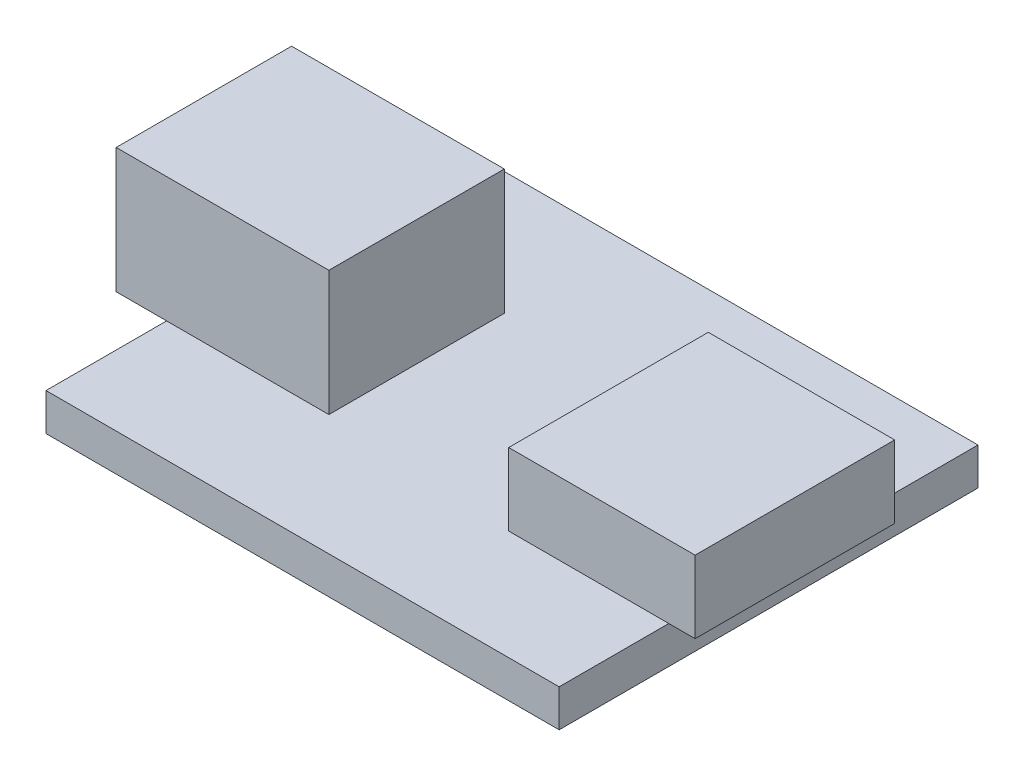
ISO-10303-21;
HEADER;
FILE_DESCRIPTION(('STEP AP214'),'2;1');
FILE_NAME('part.step','',(''),(''),'','','');
FILE_SCHEMA(('AUTOMOTIVE_DESIGN { 1 0 10303 214 1 1 1 1 }'));
ENDSEC;
DATA;
#1=APPLICATION_CONTEXT('core data for automotive mechanical design processes');
#2=APPLICATION_PROTOCOL_DEFINITION('international standard','automotive_design',2000,#1);
#3=PRODUCT_CONTEXT('',#1,'mechanical');
#4=PRODUCT('Part','Part','',(#3));
#5=PRODUCT_RELATED_PRODUCT_CATEGORY('part','',(#4));
#6=PRODUCT_DEFINITION_FORMATION('','',#4);
#7=PRODUCT_DEFINITION_CONTEXT('part definition',#1,'design');
#8=PRODUCT_DEFINITION('design','',#6,#7);
#9=PRODUCT_DEFINITION_SHAPE('','',#8);
#10=(LENGTH_UNIT() NAMED_UNIT(*) SI_UNIT(.MILLI.,.METRE.));
#11=(NAMED_UNIT(*) PLANE_ANGLE_UNIT() SI_UNIT($,.RADIAN.));
#12=(NAMED_UNIT(*) SI_UNIT($,.STERADIAN.) SOLID_ANGLE_UNIT());
#13=UNCERTAINTY_MEASURE_WITH_UNIT(LENGTH_MEASURE(1.E-05),#10,'distance_accuracy_value','');
#14=(GEOMETRIC_REPRESENTATION_CONTEXT(3) GLOBAL_UNCERTAINTY_ASSIGNED_CONTEXT((#13)) GLOBAL_UNIT_ASSIGNED_CONTEXT((#10,
#11,#12)) REPRESENTATION_CONTEXT('',''));
#15=CARTESIAN_POINT('',(0.,0.,0.));
#16=DIRECTION('',(0.,0.,1.));
#17=DIRECTION('',(1.,0.,0.));
#18=AXIS2_PLACEMENT_3D('',#15,#16,#17);
#19=CARTESIAN_POINT('',(-11.7,1.7,-9.55));
#20=DIRECTION('',(1.,0.,0.));
#21=DIRECTION('',(0.,0.,-1.));
#22=AXIS2_PLACEMENT_3D('',#19,#20,#21);
#23=PLANE('',#22);
#24=DIRECTION('',(0.,0.,1.));
#25=VECTOR('',#24,1.);
#26=CARTESIAN_POINT('',(-11.7,1.7,-3.95));
#27=LINE('',#26,#25);
#28=CARTESIAN_POINT('',(-11.7,1.7,-3.95));
#29=VERTEX_POINT('',#28);
#30=CARTESIAN_POINT('',(-11.7,1.7,4.05));
#31=VERTEX_POINT('',#30);
#32=EDGE_CURVE('E165',#29,#31,#27,.T.);
#33=ORIENTED_EDGE('',*,*,#32,.F.);
#34=DIRECTION('',(0.,0.,1.));
#35=VECTOR('',#34,1.);
#36=CARTESIAN_POINT('',(-11.7,1.7,-9.55));
#37=LINE('',#36,#35);
#38=CARTESIAN_POINT('',(-11.7,1.7,-9.55));
#39=VERTEX_POINT('',#38);
#40=EDGE_CURVE('E264',#39,#29,#37,.T.);
#41=ORIENTED_EDGE('',*,*,#40,.F.);
#42=DIRECTION('',(0.,-1.,0.));
#43=VECTOR('',#42,1.);
#44=CARTESIAN_POINT('',(-11.7,1.7,-9.55));
#45=LINE('',#44,#43);
#46=CARTESIAN_POINT('',(-11.7,0.,-9.55));
#47=VERTEX_POINT('',#46);
#48=EDGE_CURVE('E48',#39,#47,#45,.T.);
#49=ORIENTED_EDGE('',*,*,#48,.T.);
#50=DIRECTION('',(0.,0.,1.));
#51=VECTOR('',#50,1.);
#52=CARTESIAN_POINT('',(-11.7,0.,-9.55));
#53=LINE('',#52,#51);
#54=CARTESIAN_POINT('',(-11.7,0.,9.55));
#55=VERTEX_POINT('',#54);
#56=EDGE_CURVE('E277',#47,#55,#53,.T.);
#57=ORIENTED_EDGE('',*,*,#56,.T.);
#58=DIRECTION('',(0.,-1.,0.));
#59=VECTOR('',#58,1.);
#60=CARTESIAN_POINT('',(-11.7,1.7,9.55));
#61=LINE('',#60,#59);
#62=CARTESIAN_POINT('',(-11.7,1.7,9.55));
#63=VERTEX_POINT('',#62);
#64=EDGE_CURVE('E286',#63,#55,#61,.T.);
#65=ORIENTED_EDGE('',*,*,#64,.F.);
#66=EDGE_CURVE('E263',#31,#63,#37,.T.);
#67=ORIENTED_EDGE('',*,*,#66,.F.);
#68=EDGE_LOOP('',(#33,#41,#49,#57,#65,#67));
#69=FACE_BOUND('',#68,.T.);
#70=ADVANCED_FACE('F39',(#69),#23,.F.);
#71=CARTESIAN_POINT('',(0.,1.7,0.));
#72=DIRECTION('',(0.,1.,0.));
#73=DIRECTION('',(0.,0.,1.));
#74=AXIS2_PLACEMENT_3D('',#71,#72,#73);
#75=PLANE('',#74);
#76=DIRECTION('',(0.,0.,-1.));
#77=VECTOR('',#76,1.);
#78=CARTESIAN_POINT('',(-4.29999999999999,1.7,-3.95));
#79=LINE('',#78,#77);
#80=CARTESIAN_POINT('',(-4.29999999999999,1.7,4.05));
#81=VERTEX_POINT('',#80);
#82=CARTESIAN_POINT('',(-4.29999999999999,1.7,-3.95));
#83=VERTEX_POINT('',#82);
#84=EDGE_CURVE('E176',#81,#83,#79,.T.);
#85=ORIENTED_EDGE('',*,*,#84,.F.);
#86=DIRECTION('',(1.,0.,0.));
#87=VECTOR('',#86,1.);
#88=CARTESIAN_POINT('',(-11.7,1.7,4.05));
#89=LINE('',#88,#87);
#90=EDGE_CURVE('E172',#31,#81,#89,.T.);
#91=ORIENTED_EDGE('',*,*,#90,.F.);
#92=ORIENTED_EDGE('',*,*,#66,.T.);
#93=DIRECTION('',(1.,0.,0.));
#94=VECTOR('',#93,1.);
#95=CARTESIAN_POINT('',(-11.7,1.7,9.55));
#96=LINE('',#95,#94);
#97=CARTESIAN_POINT('',(11.7,1.7,9.55));
#98=VERTEX_POINT('',#97);
#99=EDGE_CURVE('E267',#63,#98,#96,.T.);
#100=ORIENTED_EDGE('',*,*,#99,.T.);
#101=DIRECTION('',(0.,0.,-1.));
#102=VECTOR('',#101,1.);
#103=CARTESIAN_POINT('',(11.7,1.7,-9.55));
#104=LINE('',#103,#102);
#105=CARTESIAN_POINT('',(11.7,1.7,4.55));
#106=VERTEX_POINT('',#105);
#107=EDGE_CURVE('E255',#98,#106,#104,.T.);
#108=ORIENTED_EDGE('',*,*,#107,.T.);
#109=DIRECTION('',(1.,0.,0.));
#110=VECTOR('',#109,1.);
#111=CARTESIAN_POINT('',(4.40000000000001,1.7,4.55));
#112=LINE('',#111,#110);
#113=CARTESIAN_POINT('',(4.40000000000001,1.7,4.55));
#114=VERTEX_POINT('',#113);
#115=EDGE_CURVE('E241',#114,#106,#112,.T.);
#116=ORIENTED_EDGE('',*,*,#115,.F.);
#117=DIRECTION('',(0.,0.,1.));
#118=VECTOR('',#117,1.);
#119=CARTESIAN_POINT('',(4.40000000000001,1.7,-4.55));
#120=LINE('',#119,#118);
#121=CARTESIAN_POINT('',(4.40000000000001,1.7,-4.55));
#122=VERTEX_POINT('',#121);
#123=EDGE_CURVE('E63',#122,#114,#120,.T.);
#124=ORIENTED_EDGE('',*,*,#123,.F.);
#125=DIRECTION('',(-1.,0.,0.));
#126=VECTOR('',#125,1.);
#127=CARTESIAN_POINT('',(4.40000000000001,1.7,-4.55));
#128=LINE('',#127,#126);
#129=CARTESIAN_POINT('',(11.7,1.7,-4.55));
#130=VERTEX_POINT('',#129);
#131=EDGE_CURVE('E232',#130,#122,#128,.T.);
#132=ORIENTED_EDGE('',*,*,#131,.F.);
#133=CARTESIAN_POINT('',(11.7,1.7,-9.55));
#134=VERTEX_POINT('',#133);
#135=EDGE_CURVE('E260',#130,#134,#104,.T.);
#136=ORIENTED_EDGE('',*,*,#135,.T.);
#137=DIRECTION('',(-1.,0.,0.));
#138=VECTOR('',#137,1.);
#139=CARTESIAN_POINT('',(-11.7,1.7,-9.55));
#140=LINE('',#139,#138);
#141=EDGE_CURVE('E259',#134,#39,#140,.T.);
#142=ORIENTED_EDGE('',*,*,#141,.T.);
#143=ORIENTED_EDGE('',*,*,#40,.T.);
#144=DIRECTION('',(-1.,0.,0.));
#145=VECTOR('',#144,1.);
#146=CARTESIAN_POINT('',(-11.7,1.7,-3.95));
#147=LINE('',#146,#145);
#148=EDGE_CURVE('E169',#83,#29,#147,.T.);
#149=ORIENTED_EDGE('',*,*,#148,.F.);
#150=EDGE_LOOP('',(#85,#91,#92,#100,#108,#116,#124,#132,#136,#142,#143,#149));
#151=FACE_BOUND('',#150,.T.);
#152=ADVANCED_FACE('F310',(#151),#75,.T.);
#153=CARTESIAN_POINT('',(11.7,1.7,-9.55));
#154=DIRECTION('',(-1.,0.,0.));
#155=DIRECTION('',(0.,0.,1.));
#156=AXIS2_PLACEMENT_3D('',#153,#154,#155);
#157=PLANE('',#156);
#158=DIRECTION('',(0.,0.,-1.));
#159=VECTOR('',#158,1.);
#160=CARTESIAN_POINT('',(11.7,1.7,4.55));
#161=LINE('',#160,#159);
#162=EDGE_CURVE('E200',#106,#130,#161,.T.);
#163=ORIENTED_EDGE('',*,*,#162,.F.);
#164=ORIENTED_EDGE('',*,*,#107,.F.);
#165=DIRECTION('',(0.,-1.,0.));
#166=VECTOR('',#165,1.);
#167=CARTESIAN_POINT('',(11.7,1.7,9.55));
#168=LINE('',#167,#166);
#169=CARTESIAN_POINT('',(11.7,0.,9.55));
#170=VERTEX_POINT('',#169);
#171=EDGE_CURVE('E270',#98,#170,#168,.T.);
#172=ORIENTED_EDGE('',*,*,#171,.T.);
#173=DIRECTION('',(0.,0.,-1.));
#174=VECTOR('',#173,1.);
#175=CARTESIAN_POINT('',(11.7,0.,-9.55));
#176=LINE('',#175,#174);
#177=CARTESIAN_POINT('',(11.7,0.,-9.55));
#178=VERTEX_POINT('',#177);
#179=EDGE_CURVE('E254',#170,#178,#176,.T.);
#180=ORIENTED_EDGE('',*,*,#179,.T.);
#181=DIRECTION('',(0.,-1.,0.));
#182=VECTOR('',#181,1.);
#183=CARTESIAN_POINT('',(11.7,1.7,-9.55));
#184=LINE('',#183,#182);
#185=EDGE_CURVE('E11',#134,#178,#184,.T.);
#186=ORIENTED_EDGE('',*,*,#185,.F.);
#187=ORIENTED_EDGE('',*,*,#135,.F.);
#188=EDGE_LOOP('',(#163,#164,#172,#180,#186,#187));
#189=FACE_BOUND('',#188,.T.);
#190=ADVANCED_FACE('F41',(#189),#157,.F.);
#191=CARTESIAN_POINT('',(-11.7,1.7,-9.55));
#192=DIRECTION('',(0.,0.,1.));
#193=DIRECTION('',(1.,0.,0.));
#194=AXIS2_PLACEMENT_3D('',#191,#192,#193);
#195=PLANE('',#194);
#196=DIRECTION('',(-1.,0.,0.));
#197=VECTOR('',#196,1.);
#198=CARTESIAN_POINT('',(-11.7,0.,-9.55));
#199=LINE('',#198,#197);
#200=EDGE_CURVE('E274',#178,#47,#199,.T.);
#201=ORIENTED_EDGE('',*,*,#200,.T.);
#202=ORIENTED_EDGE('',*,*,#48,.F.);
#203=ORIENTED_EDGE('',*,*,#141,.F.);
#204=ORIENTED_EDGE('',*,*,#185,.T.);
#205=EDGE_LOOP('',(#201,#202,#203,#204));
#206=FACE_BOUND('',#205,.T.);
#207=ADVANCED_FACE('F332',(#206),#195,.F.);
#208=CARTESIAN_POINT('',(-11.7,1.7,9.55));
#209=DIRECTION('',(0.,0.,-1.));
#210=DIRECTION('',(-1.,0.,0.));
#211=AXIS2_PLACEMENT_3D('',#208,#209,#210);
#212=PLANE('',#211);
#213=DIRECTION('',(1.,0.,0.));
#214=VECTOR('',#213,1.);
#215=CARTESIAN_POINT('',(-11.7,0.,9.55));
#216=LINE('',#215,#214);
#217=EDGE_CURVE('E280',#55,#170,#216,.T.);
#218=ORIENTED_EDGE('',*,*,#217,.T.);
#219=ORIENTED_EDGE('',*,*,#171,.F.);
#220=ORIENTED_EDGE('',*,*,#99,.F.);
#221=ORIENTED_EDGE('',*,*,#64,.T.);
#222=EDGE_LOOP('',(#218,#219,#220,#221));
#223=FACE_BOUND('',#222,.T.);
#224=ADVANCED_FACE('F304',(#223),#212,.F.);
#225=CARTESIAN_POINT('',(0.,0.,0.));
#226=DIRECTION('',(0.,1.,0.));
#227=DIRECTION('',(0.,0.,1.));
#228=AXIS2_PLACEMENT_3D('',#225,#226,#227);
#229=PLANE('',#228);
#230=ORIENTED_EDGE('',*,*,#179,.F.);
#231=ORIENTED_EDGE('',*,*,#217,.F.);
#232=ORIENTED_EDGE('',*,*,#56,.F.);
#233=ORIENTED_EDGE('',*,*,#200,.F.);
#234=EDGE_LOOP('',(#230,#231,#232,#233));
#235=FACE_BOUND('',#234,.T.);
#236=ADVANCED_FACE('F301',(#235),#229,.F.);
#237=CARTESIAN_POINT('',(4.40000000000001,5.,-4.55));
#238=DIRECTION('',(1.,0.,0.));
#239=DIRECTION('',(0.,0.,-1.));
#240=AXIS2_PLACEMENT_3D('',#237,#238,#239);
#241=PLANE('',#240);
#242=ORIENTED_EDGE('',*,*,#123,.T.);
#243=DIRECTION('',(0.,-1.,0.));
#244=VECTOR('',#243,1.);
#245=CARTESIAN_POINT('',(4.40000000000001,5.,4.55));
#246=LINE('',#245,#244);
#247=CARTESIAN_POINT('',(4.40000000000001,5.,4.55));
#248=VERTEX_POINT('',#247);
#249=EDGE_CURVE('E250',#248,#114,#246,.T.);
#250=ORIENTED_EDGE('',*,*,#249,.F.);
#251=DIRECTION('',(0.,0.,1.));
#252=VECTOR('',#251,1.);
#253=CARTESIAN_POINT('',(4.40000000000001,5.,-4.55));
#254=LINE('',#253,#252);
#255=CARTESIAN_POINT('',(4.40000000000001,5.,-4.55));
#256=VERTEX_POINT('',#255);
#257=EDGE_CURVE('E227',#256,#248,#254,.T.);
#258=ORIENTED_EDGE('',*,*,#257,.F.);
#259=DIRECTION('',(0.,-1.,0.));
#260=VECTOR('',#259,1.);
#261=CARTESIAN_POINT('',(4.40000000000001,5.,-4.55));
#262=LINE('',#261,#260);
#263=EDGE_CURVE('E238',#256,#122,#262,.T.);
#264=ORIENTED_EDGE('',*,*,#263,.T.);
#265=EDGE_LOOP('',(#242,#250,#258,#264));
#266=FACE_BOUND('',#265,.T.);
#267=ADVANCED_FACE('F328',(#266),#241,.F.);
#268=CARTESIAN_POINT('',(4.40000000000001,5.,4.55));
#269=DIRECTION('',(0.,0.,-1.));
#270=DIRECTION('',(-1.,0.,0.));
#271=AXIS2_PLACEMENT_3D('',#268,#269,#270);
#272=PLANE('',#271);
#273=ORIENTED_EDGE('',*,*,#115,.T.);
#274=DIRECTION('',(-1.,0.,0.));
#275=VECTOR('',#274,1.);
#276=CARTESIAN_POINT('',(12.9,1.7,4.55));
#277=LINE('',#276,#275);
#278=CARTESIAN_POINT('',(12.9,1.7,4.55));
#279=VERTEX_POINT('',#278);
#280=EDGE_CURVE('E223',#279,#106,#277,.T.);
#281=ORIENTED_EDGE('',*,*,#280,.F.);
#282=DIRECTION('',(0.,-1.,0.));
#283=VECTOR('',#282,1.);
#284=CARTESIAN_POINT('',(12.9,5.,4.55));
#285=LINE('',#284,#283);
#286=CARTESIAN_POINT('',(12.9,5.,4.55));
#287=VERTEX_POINT('',#286);
#288=EDGE_CURVE('E201',#287,#279,#285,.T.);
#289=ORIENTED_EDGE('',*,*,#288,.F.);
#290=DIRECTION('',(1.,0.,0.));
#291=VECTOR('',#290,1.);
#292=CARTESIAN_POINT('',(4.40000000000001,5.,4.55));
#293=LINE('',#292,#291);
#294=EDGE_CURVE('E231',#248,#287,#293,.T.);
#295=ORIENTED_EDGE('',*,*,#294,.F.);
#296=ORIENTED_EDGE('',*,*,#249,.T.);
#297=EDGE_LOOP('',(#273,#281,#289,#295,#296));
#298=FACE_BOUND('',#297,.T.);
#299=ADVANCED_FACE('F313',(#298),#272,.F.);
#300=CARTESIAN_POINT('',(4.40000000000001,5.,-4.55));
#301=DIRECTION('',(0.,0.,1.));
#302=DIRECTION('',(1.,0.,0.));
#303=AXIS2_PLACEMENT_3D('',#300,#301,#302);
#304=PLANE('',#303);
#305=ORIENTED_EDGE('',*,*,#131,.T.);
#306=ORIENTED_EDGE('',*,*,#263,.F.);
#307=DIRECTION('',(-1.,0.,0.));
#308=VECTOR('',#307,1.);
#309=CARTESIAN_POINT('',(4.40000000000001,5.,-4.55));
#310=LINE('',#309,#308);
#311=CARTESIAN_POINT('',(12.9,5.,-4.55));
#312=VERTEX_POINT('',#311);
#313=EDGE_CURVE('E235',#312,#256,#310,.T.);
#314=ORIENTED_EDGE('',*,*,#313,.F.);
#315=DIRECTION('',(0.,1.,0.));
#316=VECTOR('',#315,1.);
#317=CARTESIAN_POINT('',(12.9,5.,-4.55));
#318=LINE('',#317,#316);
#319=CARTESIAN_POINT('',(12.9,1.7,-4.55));
#320=VERTEX_POINT('',#319);
#321=EDGE_CURVE('E208',#320,#312,#318,.T.);
#322=ORIENTED_EDGE('',*,*,#321,.F.);
#323=DIRECTION('',(-1.,0.,0.));
#324=VECTOR('',#323,1.);
#325=CARTESIAN_POINT('',(12.9,1.7,-4.55));
#326=LINE('',#325,#324);
#327=EDGE_CURVE('E216',#320,#130,#326,.T.);
#328=ORIENTED_EDGE('',*,*,#327,.T.);
#329=EDGE_LOOP('',(#305,#306,#314,#322,#328));
#330=FACE_BOUND('',#329,.T.);
#331=ADVANCED_FACE('F330',(#330),#304,.F.);
#332=CARTESIAN_POINT('',(0.,5.,0.));
#333=DIRECTION('',(0.,1.,0.));
#334=DIRECTION('',(0.,0.,1.));
#335=AXIS2_PLACEMENT_3D('',#332,#333,#334);
#336=PLANE('',#335);
#337=ORIENTED_EDGE('',*,*,#257,.T.);
#338=ORIENTED_EDGE('',*,*,#294,.T.);
#339=DIRECTION('',(0.,0.,1.));
#340=VECTOR('',#339,1.);
#341=CARTESIAN_POINT('',(12.9,5.,4.55));
#342=LINE('',#341,#340);
#343=EDGE_CURVE('E212',#312,#287,#342,.T.);
#344=ORIENTED_EDGE('',*,*,#343,.F.);
#345=ORIENTED_EDGE('',*,*,#313,.T.);
#346=EDGE_LOOP('',(#337,#338,#344,#345));
#347=FACE_BOUND('',#346,.T.);
#348=ADVANCED_FACE('F325',(#347),#336,.T.);
#349=CARTESIAN_POINT('',(12.9,1.7,4.55));
#350=DIRECTION('',(0.,1.,0.));
#351=DIRECTION('',(0.,0.,1.));
#352=AXIS2_PLACEMENT_3D('',#349,#350,#351);
#353=PLANE('',#352);
#354=ORIENTED_EDGE('',*,*,#162,.T.);
#355=ORIENTED_EDGE('',*,*,#327,.F.);
#356=DIRECTION('',(0.,0.,-1.));
#357=VECTOR('',#356,1.);
#358=CARTESIAN_POINT('',(12.9,1.7,4.55));
#359=LINE('',#358,#357);
#360=EDGE_CURVE('E205',#279,#320,#359,.T.);
#361=ORIENTED_EDGE('',*,*,#360,.F.);
#362=ORIENTED_EDGE('',*,*,#280,.T.);
#363=EDGE_LOOP('',(#354,#355,#361,#362));
#364=FACE_BOUND('',#363,.T.);
#365=ADVANCED_FACE('F317',(#364),#353,.F.);
#366=CARTESIAN_POINT('',(12.9,0.,0.));
#367=DIRECTION('',(1.,0.,0.));
#368=DIRECTION('',(0.,0.,-1.));
#369=AXIS2_PLACEMENT_3D('',#366,#367,#368);
#370=PLANE('',#369);
#371=ORIENTED_EDGE('',*,*,#288,.T.);
#372=ORIENTED_EDGE('',*,*,#360,.T.);
#373=ORIENTED_EDGE('',*,*,#321,.T.);
#374=ORIENTED_EDGE('',*,*,#343,.T.);
#375=EDGE_LOOP('',(#371,#372,#373,#374));
#376=FACE_BOUND('',#375,.T.);
#377=ADVANCED_FACE('F321',(#376),#370,.T.);
#378=CARTESIAN_POINT('',(-11.7,7.4,4.05));
#379=DIRECTION('',(0.,0.,-1.));
#380=DIRECTION('',(-1.,0.,0.));
#381=AXIS2_PLACEMENT_3D('',#378,#379,#380);
#382=PLANE('',#381);
#383=ORIENTED_EDGE('',*,*,#90,.T.);
#384=DIRECTION('',(0.,-1.,0.));
#385=VECTOR('',#384,1.);
#386=CARTESIAN_POINT('',(-4.29999999999999,7.4,4.05));
#387=LINE('',#386,#385);
#388=CARTESIAN_POINT('',(-4.29999999999999,7.4,4.05));
#389=VERTEX_POINT('',#388);
#390=EDGE_CURVE('E196',#389,#81,#387,.T.);
#391=ORIENTED_EDGE('',*,*,#390,.F.);
#392=DIRECTION('',(1.,0.,0.));
#393=VECTOR('',#392,1.);
#394=CARTESIAN_POINT('',(-11.7,7.4,4.05));
#395=LINE('',#394,#393);
#396=CARTESIAN_POINT('',(-14.,7.4,4.05));
#397=VERTEX_POINT('',#396);
#398=EDGE_CURVE('E181',#397,#389,#395,.T.);
#399=ORIENTED_EDGE('',*,*,#398,.F.);
#400=DIRECTION('',(0.,1.,0.));
#401=VECTOR('',#400,1.);
#402=CARTESIAN_POINT('',(-14.,7.4,4.05));
#403=LINE('',#402,#401);
#404=CARTESIAN_POINT('',(-14.,1.7,4.05));
#405=VERTEX_POINT('',#404);
#406=EDGE_CURVE('E156',#405,#397,#403,.T.);
#407=ORIENTED_EDGE('',*,*,#406,.F.);
#408=DIRECTION('',(1.,0.,0.));
#409=VECTOR('',#408,1.);
#410=CARTESIAN_POINT('',(-14.,1.7,4.05));
#411=LINE('',#410,#409);
#412=EDGE_CURVE('E151',#405,#31,#411,.T.);
#413=ORIENTED_EDGE('',*,*,#412,.T.);
#414=EDGE_LOOP('',(#383,#391,#399,#407,#413));
#415=FACE_BOUND('',#414,.T.);
#416=ADVANCED_FACE('F360',(#415),#382,.F.);
#417=CARTESIAN_POINT('',(-4.29999999999999,7.4,-3.95));
#418=DIRECTION('',(-1.,0.,0.));
#419=DIRECTION('',(0.,0.,1.));
#420=AXIS2_PLACEMENT_3D('',#417,#418,#419);
#421=PLANE('',#420);
#422=ORIENTED_EDGE('',*,*,#84,.T.);
#423=DIRECTION('',(0.,-1.,0.));
#424=VECTOR('',#423,1.);
#425=CARTESIAN_POINT('',(-4.29999999999999,7.4,-3.95));
#426=LINE('',#425,#424);
#427=CARTESIAN_POINT('',(-4.29999999999999,7.4,-3.95));
#428=VERTEX_POINT('',#427);
#429=EDGE_CURVE('E55',#428,#83,#426,.T.);
#430=ORIENTED_EDGE('',*,*,#429,.F.);
#431=DIRECTION('',(0.,0.,-1.));
#432=VECTOR('',#431,1.);
#433=CARTESIAN_POINT('',(-4.29999999999999,7.4,-3.95));
#434=LINE('',#433,#432);
#435=EDGE_CURVE('E184',#389,#428,#434,.T.);
#436=ORIENTED_EDGE('',*,*,#435,.F.);
#437=ORIENTED_EDGE('',*,*,#390,.T.);
#438=EDGE_LOOP('',(#422,#430,#436,#437));
#439=FACE_BOUND('',#438,.T.);
#440=ADVANCED_FACE('F363',(#439),#421,.F.);
#441=CARTESIAN_POINT('',(-11.7,7.4,-3.95));
#442=DIRECTION('',(0.,0.,1.));
#443=DIRECTION('',(1.,0.,0.));
#444=AXIS2_PLACEMENT_3D('',#441,#442,#443);
#445=PLANE('',#444);
#446=ORIENTED_EDGE('',*,*,#148,.T.);
#447=DIRECTION('',(1.,0.,0.));
#448=VECTOR('',#447,1.);
#449=CARTESIAN_POINT('',(-14.,1.7,-3.95));
#450=LINE('',#449,#448);
#451=CARTESIAN_POINT('',(-14.,1.7,-3.95));
#452=VERTEX_POINT('',#451);
#453=EDGE_CURVE('E149',#452,#29,#450,.T.);
#454=ORIENTED_EDGE('',*,*,#453,.F.);
#455=DIRECTION('',(0.,-1.,0.));
#456=VECTOR('',#455,1.);
#457=CARTESIAN_POINT('',(-14.,7.4,-3.95));
#458=LINE('',#457,#456);
#459=CARTESIAN_POINT('',(-14.,7.4,-3.95));
#460=VERTEX_POINT('',#459);
#461=EDGE_CURVE('E157',#460,#452,#458,.T.);
#462=ORIENTED_EDGE('',*,*,#461,.F.);
#463=DIRECTION('',(-1.,0.,0.));
#464=VECTOR('',#463,1.);
#465=CARTESIAN_POINT('',(-11.7,7.4,-3.95));
#466=LINE('',#465,#464);
#467=EDGE_CURVE('E187',#428,#460,#466,.T.);
#468=ORIENTED_EDGE('',*,*,#467,.F.);
#469=ORIENTED_EDGE('',*,*,#429,.T.);
#470=EDGE_LOOP('',(#446,#454,#462,#468,#469));
#471=FACE_BOUND('',#470,.T.);
#472=ADVANCED_FACE('F167',(#471),#445,.F.);
#473=CARTESIAN_POINT('',(0.,7.4,0.));
#474=DIRECTION('',(0.,1.,0.));
#475=DIRECTION('',(0.,0.,1.));
#476=AXIS2_PLACEMENT_3D('',#473,#474,#475);
#477=PLANE('',#476);
#478=ORIENTED_EDGE('',*,*,#467,.T.);
#479=DIRECTION('',(0.,0.,-1.));
#480=VECTOR('',#479,1.);
#481=CARTESIAN_POINT('',(-14.,7.4,-3.95));
#482=LINE('',#481,#480);
#483=EDGE_CURVE('E163',#397,#460,#482,.T.);
#484=ORIENTED_EDGE('',*,*,#483,.F.);
#485=ORIENTED_EDGE('',*,*,#398,.T.);
#486=ORIENTED_EDGE('',*,*,#435,.T.);
#487=EDGE_LOOP('',(#478,#484,#485,#486));
#488=FACE_BOUND('',#487,.T.);
#489=ADVANCED_FACE('F370',(#488),#477,.T.);
#490=CARTESIAN_POINT('',(-14.,1.7,-3.95));
#491=DIRECTION('',(0.,1.,0.));
#492=DIRECTION('',(0.,0.,1.));
#493=AXIS2_PLACEMENT_3D('',#490,#491,#492);
#494=PLANE('',#493);
#495=ORIENTED_EDGE('',*,*,#32,.T.);
#496=ORIENTED_EDGE('',*,*,#412,.F.);
#497=DIRECTION('',(0.,0.,1.));
#498=VECTOR('',#497,1.);
#499=CARTESIAN_POINT('',(-14.,1.7,-3.95));
#500=LINE('',#499,#498);
#501=EDGE_CURVE('E144',#452,#405,#500,.T.);
#502=ORIENTED_EDGE('',*,*,#501,.F.);
#503=ORIENTED_EDGE('',*,*,#453,.T.);
#504=EDGE_LOOP('',(#495,#496,#502,#503));
#505=FACE_BOUND('',#504,.T.);
#506=ADVANCED_FACE('F147',(#505),#494,.F.);
#507=CARTESIAN_POINT('',(-14.,0.,0.));
#508=DIRECTION('',(-1.,0.,0.));
#509=DIRECTION('',(0.,0.,1.));
#510=AXIS2_PLACEMENT_3D('',#507,#508,#509);
#511=PLANE('',#510);
#512=ORIENTED_EDGE('',*,*,#461,.T.);
#513=ORIENTED_EDGE('',*,*,#501,.T.);
#514=ORIENTED_EDGE('',*,*,#406,.T.);
#515=ORIENTED_EDGE('',*,*,#483,.T.);
#516=EDGE_LOOP('',(#512,#513,#514,#515));
#517=FACE_BOUND('',#516,.T.);
#518=ADVANCED_FACE('F161',(#517),#511,.T.);
#519=CLOSED_SHELL('',(#70,#152,#190,#207,#224,#236,#267,#299,#331,#348,#365,#377,#416,#440,#472,
#489,#506,#518));
#520=MANIFOLD_SOLID_BREP('B2',#519);
#521=ADVANCED_BREP_SHAPE_REPRESENTATION('',(#18,#520),#14);
#522=SHAPE_DEFINITION_REPRESENTATION(#9,#521);
ENDSEC;
END-ISO-10303-21;
